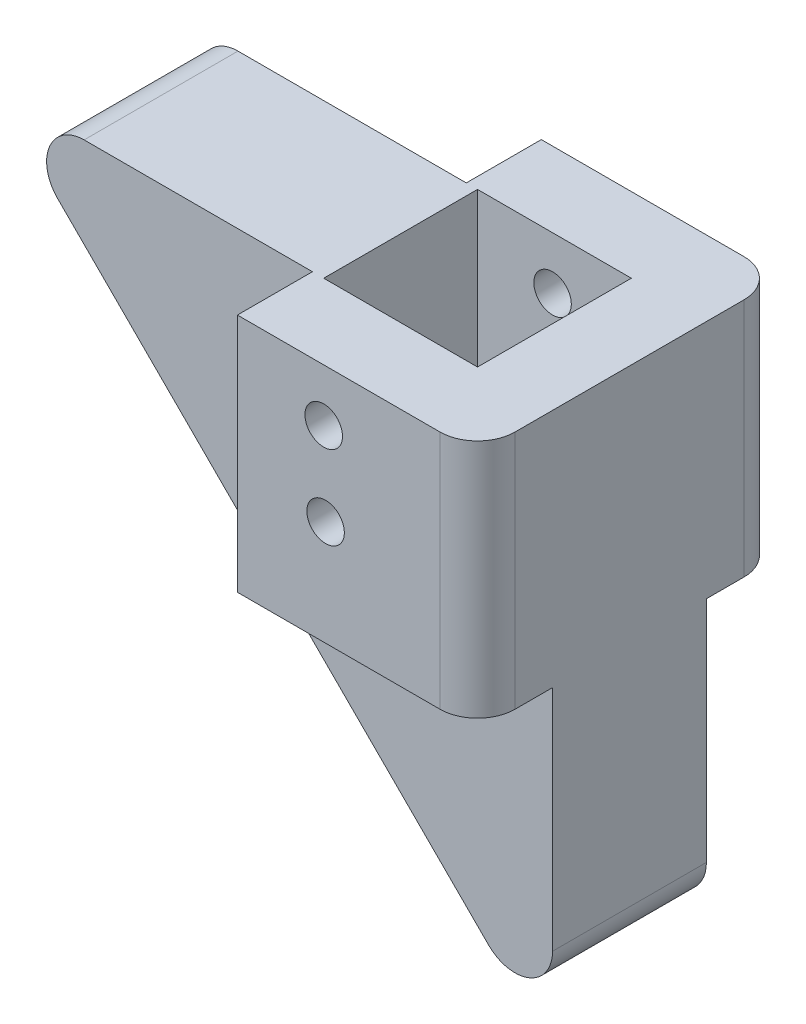
ISO-10303-21;
HEADER;
FILE_DESCRIPTION(('STEP AP214'),'2;1');
FILE_NAME('part.step','',(''),(''),'','','');
FILE_SCHEMA(('AUTOMOTIVE_DESIGN { 1 0 10303 214 1 1 1 1 }'));
ENDSEC;
DATA;
#1=APPLICATION_CONTEXT('core data for automotive mechanical design processes');
#2=APPLICATION_PROTOCOL_DEFINITION('international standard','automotive_design',2000,#1);
#3=PRODUCT_CONTEXT('',#1,'mechanical');
#4=PRODUCT('Part','Part','',(#3));
#5=PRODUCT_RELATED_PRODUCT_CATEGORY('part','',(#4));
#6=PRODUCT_DEFINITION_FORMATION('','',#4);
#7=PRODUCT_DEFINITION_CONTEXT('part definition',#1,'design');
#8=PRODUCT_DEFINITION('design','',#6,#7);
#9=PRODUCT_DEFINITION_SHAPE('','',#8);
#10=(LENGTH_UNIT() NAMED_UNIT(*) SI_UNIT(.MILLI.,.METRE.));
#11=(NAMED_UNIT(*) PLANE_ANGLE_UNIT() SI_UNIT($,.RADIAN.));
#12=(NAMED_UNIT(*) SI_UNIT($,.STERADIAN.) SOLID_ANGLE_UNIT());
#13=UNCERTAINTY_MEASURE_WITH_UNIT(LENGTH_MEASURE(1.E-05),#10,'distance_accuracy_value','');
#14=(GEOMETRIC_REPRESENTATION_CONTEXT(3) GLOBAL_UNCERTAINTY_ASSIGNED_CONTEXT((#13)) GLOBAL_UNIT_ASSIGNED_CONTEXT((#10,
#11,#12)) REPRESENTATION_CONTEXT('',''));
#15=CARTESIAN_POINT('',(0.,0.,0.));
#16=DIRECTION('',(0.,0.,1.));
#17=DIRECTION('',(1.,0.,0.));
#18=AXIS2_PLACEMENT_3D('',#15,#16,#17);
#19=CARTESIAN_POINT('',(0.,0.,0.));
#20=DIRECTION('',(0.,0.,1.));
#21=DIRECTION('',(1.,0.,0.));
#22=AXIS2_PLACEMENT_3D('',#19,#20,#21);
#23=PLANE('',#22);
#24=CARTESIAN_POINT('',(2.37412982933467,-20.8727925216274,0.));
#25=DIRECTION('',(0.,0.,1.));
#26=DIRECTION('',(1.,0.,0.));
#27=AXIS2_PLACEMENT_3D('',#24,#25,#26);
#28=CIRCLE('',#27,2.5);
#29=CARTESIAN_POINT('',(4.87412982933467,-20.8727925216274,0.));
#30=VERTEX_POINT('',#29);
#31=EDGE_CURVE('E208',#30,#30,#28,.T.);
#32=ORIENTED_EDGE('',*,*,#31,.T.);
#33=EDGE_LOOP('',(#32));
#34=FACE_BOUND('',#33,.T.);
#35=CARTESIAN_POINT('',(-12.298157313412,-6.20050537888066,0.));
#36=DIRECTION('',(0.,0.,1.));
#37=DIRECTION('',(1.,0.,0.));
#38=AXIS2_PLACEMENT_3D('',#35,#36,#37);
#39=CIRCLE('',#38,2.5);
#40=CARTESIAN_POINT('',(-9.79815731341203,-6.20050537888066,0.));
#41=VERTEX_POINT('',#40);
#42=EDGE_CURVE('E214',#41,#41,#39,.T.);
#43=ORIENTED_EDGE('',*,*,#42,.T.);
#44=EDGE_LOOP('',(#43));
#45=FACE_BOUND('',#44,.T.);
#46=DIRECTION('',(0.,-1.,0.));
#47=VECTOR('',#46,1.);
#48=CARTESIAN_POINT('',(26.701842686588,0.,0.));
#49=LINE('',#48,#47);
#50=CARTESIAN_POINT('',(26.701842686588,-13.8727925216274,0.));
#51=VERTEX_POINT('',#50);
#52=CARTESIAN_POINT('',(26.701842686588,-44.3017247097626,0.));
#53=VERTEX_POINT('',#52);
#54=EDGE_CURVE('E259',#51,#53,#49,.T.);
#55=ORIENTED_EDGE('',*,*,#54,.T.);
#56=CARTESIAN_POINT('',(21.701842686588,-44.3017247097626,0.));
#57=DIRECTION('',(0.,0.,1.));
#58=DIRECTION('',(1.,0.,0.));
#59=AXIS2_PLACEMENT_3D('',#56,#57,#58);
#60=CIRCLE('',#59,5.);
#61=CARTESIAN_POINT('',(18.1663087806552,-47.8372586156953,0.));
#62=VERTEX_POINT('',#61);
#63=EDGE_CURVE('E319',#53,#62,#60,.F.);
#64=ORIENTED_EDGE('',*,*,#63,.T.);
#65=DIRECTION('',(-0.707106781186544,0.707106781186551,0.));
#66=VECTOR('',#65,1.);
#67=CARTESIAN_POINT('',(-14.8354749175199,-14.8354749175198,0.));
#68=LINE('',#67,#66);
#69=CARTESIAN_POINT('',(-39.2626234074794,9.59167357243993,0.));
#70=VERTEX_POINT('',#69);
#71=EDGE_CURVE('E283',#62,#70,#68,.T.);
#72=ORIENTED_EDGE('',*,*,#71,.T.);
#73=CARTESIAN_POINT('',(-35.7270895015466,13.1272074783726,0.));
#74=DIRECTION('',(0.,0.,1.));
#75=DIRECTION('',(1.,0.,0.));
#76=AXIS2_PLACEMENT_3D('',#73,#74,#75);
#77=CIRCLE('',#76,5.);
#78=CARTESIAN_POINT('',(-35.7270895015466,18.1272074783727,0.));
#79=VERTEX_POINT('',#78);
#80=EDGE_CURVE('E317',#70,#79,#77,.F.);
#81=ORIENTED_EDGE('',*,*,#80,.T.);
#82=DIRECTION('',(1.,0.,0.));
#83=VECTOR('',#82,1.);
#84=CARTESIAN_POINT('',(0.,18.1272074783727,0.));
#85=LINE('',#84,#83);
#86=CARTESIAN_POINT('',(-5.29815731341203,18.1272074783727,0.));
#87=VERTEX_POINT('',#86);
#88=EDGE_CURVE('E281',#79,#87,#85,.T.);
#89=ORIENTED_EDGE('',*,*,#88,.T.);
#90=DIRECTION('',(0.,1.,0.));
#91=VECTOR('',#90,1.);
#92=CARTESIAN_POINT('',(-5.29815731341203,-13.8727925216274,0.));
#93=LINE('',#92,#91);
#94=CARTESIAN_POINT('',(-5.29815731341203,-13.8727925216274,0.));
#95=VERTEX_POINT('',#94);
#96=EDGE_CURVE('E247',#95,#87,#93,.T.);
#97=ORIENTED_EDGE('',*,*,#96,.F.);
#98=DIRECTION('',(-1.,0.,0.));
#99=VECTOR('',#98,1.);
#100=CARTESIAN_POINT('',(26.701842686588,-13.8727925216274,0.));
#101=LINE('',#100,#99);
#102=EDGE_CURVE('E178',#51,#95,#101,.T.);
#103=ORIENTED_EDGE('',*,*,#102,.F.);
#104=EDGE_LOOP('',(#55,#64,#72,#81,#89,#97,#103));
#105=FACE_BOUND('',#104,.T.);
#106=ADVANCED_FACE('F40',(#34,#45,#105),#23,.F.);
#107=CARTESIAN_POINT('',(16.701842686588,0.,20.5));
#108=DIRECTION('',(-1.,0.,0.));
#109=DIRECTION('',(0.,0.,1.));
#110=AXIS2_PLACEMENT_3D('',#107,#108,#109);
#111=PLANE('',#110);
#112=DIRECTION('',(0.,1.,0.));
#113=VECTOR('',#112,1.);
#114=CARTESIAN_POINT('',(16.701842686588,0.,0.));
#115=LINE('',#114,#113);
#116=CARTESIAN_POINT('',(16.701842686588,-6.87279252162735,0.));
#117=VERTEX_POINT('',#116);
#118=CARTESIAN_POINT('',(16.701842686588,18.1272074783727,0.));
#119=VERTEX_POINT('',#118);
#120=EDGE_CURVE('E254',#117,#119,#115,.T.);
#121=ORIENTED_EDGE('',*,*,#120,.F.);
#122=DIRECTION('',(0.,0.,-1.));
#123=VECTOR('',#122,1.);
#124=CARTESIAN_POINT('',(16.701842686588,-6.87279252162735,20.5));
#125=LINE('',#124,#123);
#126=CARTESIAN_POINT('',(16.701842686588,-6.87279252162735,20.5));
#127=VERTEX_POINT('',#126);
#128=EDGE_CURVE('E296',#127,#117,#125,.T.);
#129=ORIENTED_EDGE('',*,*,#128,.F.);
#130=DIRECTION('',(0.,1.,0.));
#131=VECTOR('',#130,1.);
#132=CARTESIAN_POINT('',(16.701842686588,0.,20.5));
#133=LINE('',#132,#131);
#134=CARTESIAN_POINT('',(16.701842686588,18.1272074783727,20.5));
#135=VERTEX_POINT('',#134);
#136=EDGE_CURVE('E255',#127,#135,#133,.T.);
#137=ORIENTED_EDGE('',*,*,#136,.T.);
#138=DIRECTION('',(0.,0.,-1.));
#139=VECTOR('',#138,1.);
#140=CARTESIAN_POINT('',(16.701842686588,18.1272074783727,20.5));
#141=LINE('',#140,#139);
#142=EDGE_CURVE('E272',#135,#119,#141,.T.);
#143=ORIENTED_EDGE('',*,*,#142,.T.);
#144=EDGE_LOOP('',(#121,#129,#137,#143));
#145=FACE_BOUND('',#144,.T.);
#146=ADVANCED_FACE('F381',(#145),#111,.T.);
#147=CARTESIAN_POINT('',(0.,-6.87279252162735,20.5));
#148=DIRECTION('',(0.,1.,0.));
#149=DIRECTION('',(0.,0.,1.));
#150=AXIS2_PLACEMENT_3D('',#147,#148,#149);
#151=PLANE('',#150);
#152=DIRECTION('',(1.,0.,0.));
#153=VECTOR('',#152,1.);
#154=CARTESIAN_POINT('',(0.,-6.87279252162735,0.));
#155=LINE('',#154,#153);
#156=CARTESIAN_POINT('',(-3.79815731341203,-6.87279252162735,0.));
#157=VERTEX_POINT('',#156);
#158=EDGE_CURVE('E275',#157,#117,#155,.T.);
#159=ORIENTED_EDGE('',*,*,#158,.F.);
#160=DIRECTION('',(0.,0.,-1.));
#161=VECTOR('',#160,1.);
#162=CARTESIAN_POINT('',(-3.79815731341203,-6.87279252162735,20.5));
#163=LINE('',#162,#161);
#164=CARTESIAN_POINT('',(-3.79815731341203,-6.87279252162735,20.5));
#165=VERTEX_POINT('',#164);
#166=EDGE_CURVE('E294',#165,#157,#163,.T.);
#167=ORIENTED_EDGE('',*,*,#166,.F.);
#168=DIRECTION('',(1.,0.,0.));
#169=VECTOR('',#168,1.);
#170=CARTESIAN_POINT('',(0.,-6.87279252162735,20.5));
#171=LINE('',#170,#169);
#172=EDGE_CURVE('E258',#165,#127,#171,.T.);
#173=ORIENTED_EDGE('',*,*,#172,.T.);
#174=ORIENTED_EDGE('',*,*,#128,.T.);
#175=EDGE_LOOP('',(#159,#167,#173,#174));
#176=FACE_BOUND('',#175,.T.);
#177=ADVANCED_FACE('F387',(#176),#151,.T.);
#178=CARTESIAN_POINT('',(-3.79815731341203,0.,20.5));
#179=DIRECTION('',(1.,0.,0.));
#180=DIRECTION('',(0.,0.,-1.));
#181=AXIS2_PLACEMENT_3D('',#178,#179,#180);
#182=PLANE('',#181);
#183=DIRECTION('',(0.,-1.,0.));
#184=VECTOR('',#183,1.);
#185=CARTESIAN_POINT('',(-3.79815731341203,0.,0.));
#186=LINE('',#185,#184);
#187=CARTESIAN_POINT('',(-3.79815731341203,18.1272074783727,0.));
#188=VERTEX_POINT('',#187);
#189=EDGE_CURVE('E278',#188,#157,#186,.T.);
#190=ORIENTED_EDGE('',*,*,#189,.F.);
#191=DIRECTION('',(0.,0.,-1.));
#192=VECTOR('',#191,1.);
#193=CARTESIAN_POINT('',(-3.79815731341203,18.1272074783727,20.5));
#194=LINE('',#193,#192);
#195=CARTESIAN_POINT('',(-3.79815731341203,18.1272074783727,20.5));
#196=VERTEX_POINT('',#195);
#197=EDGE_CURVE('E292',#196,#188,#194,.T.);
#198=ORIENTED_EDGE('',*,*,#197,.F.);
#199=DIRECTION('',(0.,-1.,0.));
#200=VECTOR('',#199,1.);
#201=CARTESIAN_POINT('',(-3.79815731341203,0.,20.5));
#202=LINE('',#201,#200);
#203=EDGE_CURVE('E262',#196,#165,#202,.T.);
#204=ORIENTED_EDGE('',*,*,#203,.T.);
#205=ORIENTED_EDGE('',*,*,#166,.T.);
#206=EDGE_LOOP('',(#190,#198,#204,#205));
#207=FACE_BOUND('',#206,.T.);
#208=ADVANCED_FACE('F401',(#207),#182,.T.);
#209=CARTESIAN_POINT('',(-14.8354749175199,-14.8354749175198,20.5));
#210=DIRECTION('',(-0.707106781186551,-0.707106781186544,0.));
#211=DIRECTION('',(0.707106781186544,-0.707106781186551,0.));
#212=AXIS2_PLACEMENT_3D('',#209,#210,#211);
#213=PLANE('',#212);
#214=ORIENTED_EDGE('',*,*,#71,.F.);
#215=DIRECTION('',(0.,0.,-1.));
#216=VECTOR('',#215,1.);
#217=CARTESIAN_POINT('',(18.1663087806552,-47.8372586156953,20.5));
#218=LINE('',#217,#216);
#219=CARTESIAN_POINT('',(18.1663087806552,-47.8372586156953,20.5));
#220=VERTEX_POINT('',#219);
#221=EDGE_CURVE('E324',#62,#220,#218,.F.);
#222=ORIENTED_EDGE('',*,*,#221,.T.);
#223=DIRECTION('',(-0.707106781186544,0.707106781186551,0.));
#224=VECTOR('',#223,1.);
#225=CARTESIAN_POINT('',(-14.8354749175199,-14.8354749175198,20.5));
#226=LINE('',#225,#224);
#227=CARTESIAN_POINT('',(-39.2626234074794,9.59167357243993,20.5));
#228=VERTEX_POINT('',#227);
#229=EDGE_CURVE('E267',#220,#228,#226,.T.);
#230=ORIENTED_EDGE('',*,*,#229,.T.);
#231=DIRECTION('',(0.,0.,-1.));
#232=VECTOR('',#231,1.);
#233=CARTESIAN_POINT('',(-39.2626234074794,9.59167357243993,20.5));
#234=LINE('',#233,#232);
#235=EDGE_CURVE('E321',#228,#70,#234,.T.);
#236=ORIENTED_EDGE('',*,*,#235,.T.);
#237=EDGE_LOOP('',(#214,#222,#230,#236));
#238=FACE_BOUND('',#237,.T.);
#239=ADVANCED_FACE('F340',(#238),#213,.T.);
#240=CARTESIAN_POINT('',(26.701842686588,0.,20.5));
#241=DIRECTION('',(1.,0.,0.));
#242=DIRECTION('',(0.,1.,0.));
#243=AXIS2_PLACEMENT_3D('',#240,#241,#242);
#244=PLANE('',#243);
#245=DIRECTION('',(0.,-1.,0.));
#246=VECTOR('',#245,1.);
#247=CARTESIAN_POINT('',(26.701842686588,0.,20.5));
#248=LINE('',#247,#246);
#249=CARTESIAN_POINT('',(26.701842686588,-13.8727925216274,20.5));
#250=VERTEX_POINT('',#249);
#251=CARTESIAN_POINT('',(26.701842686588,-44.3017247097626,20.5));
#252=VERTEX_POINT('',#251);
#253=EDGE_CURVE('E269',#250,#252,#248,.T.);
#254=ORIENTED_EDGE('',*,*,#253,.T.);
#255=DIRECTION('',(0.,0.,-1.));
#256=VECTOR('',#255,1.);
#257=CARTESIAN_POINT('',(26.701842686588,-44.3017247097626,20.5));
#258=LINE('',#257,#256);
#259=EDGE_CURVE('E314',#252,#53,#258,.T.);
#260=ORIENTED_EDGE('',*,*,#259,.T.);
#261=ORIENTED_EDGE('',*,*,#54,.F.);
#262=DIRECTION('',(0.,0.,1.));
#263=VECTOR('',#262,1.);
#264=CARTESIAN_POINT('',(26.701842686588,-13.8727925216274,-8.));
#265=LINE('',#264,#263);
#266=CARTESIAN_POINT('',(26.701842686588,-13.8727925216274,-5.));
#267=VERTEX_POINT('',#266);
#268=EDGE_CURVE('E181',#267,#51,#265,.T.);
#269=ORIENTED_EDGE('',*,*,#268,.F.);
#270=DIRECTION('',(0.,-1.,0.));
#271=VECTOR('',#270,1.);
#272=CARTESIAN_POINT('',(26.701842686588,18.1272074783727,-5.));
#273=LINE('',#272,#271);
#274=CARTESIAN_POINT('',(26.701842686588,18.1272074783727,-5.));
#275=VERTEX_POINT('',#274);
#276=EDGE_CURVE('E303',#267,#275,#273,.F.);
#277=ORIENTED_EDGE('',*,*,#276,.T.);
#278=DIRECTION('',(0.,0.,-1.));
#279=VECTOR('',#278,1.);
#280=CARTESIAN_POINT('',(26.701842686588,18.1272074783727,20.5));
#281=LINE('',#280,#279);
#282=CARTESIAN_POINT('',(26.701842686588,18.1272074783727,25.5));
#283=VERTEX_POINT('',#282);
#284=EDGE_CURVE('E289',#283,#275,#281,.T.);
#285=ORIENTED_EDGE('',*,*,#284,.F.);
#286=DIRECTION('',(0.,1.,0.));
#287=VECTOR('',#286,1.);
#288=CARTESIAN_POINT('',(26.701842686588,-13.8727925216274,25.5));
#289=LINE('',#288,#287);
#290=CARTESIAN_POINT('',(26.701842686588,-13.8727925216274,25.5));
#291=VERTEX_POINT('',#290);
#292=EDGE_CURVE('E301',#283,#291,#289,.F.);
#293=ORIENTED_EDGE('',*,*,#292,.T.);
#294=DIRECTION('',(0.,0.,-1.));
#295=VECTOR('',#294,1.);
#296=CARTESIAN_POINT('',(26.701842686588,-13.8727925216274,27.5));
#297=LINE('',#296,#295);
#298=EDGE_CURVE('E238',#291,#250,#297,.T.);
#299=ORIENTED_EDGE('',*,*,#298,.T.);
#300=EDGE_LOOP('',(#254,#260,#261,#269,#277,#285,#293,#299));
#301=FACE_BOUND('',#300,.T.);
#302=ADVANCED_FACE('F333',(#301),#244,.T.);
#303=CARTESIAN_POINT('',(0.,18.1272074783727,20.5));
#304=DIRECTION('',(0.,1.,0.));
#305=DIRECTION('',(0.,0.,1.));
#306=AXIS2_PLACEMENT_3D('',#303,#304,#305);
#307=PLANE('',#306);
#308=DIRECTION('',(-1.,0.,0.));
#309=VECTOR('',#308,1.);
#310=CARTESIAN_POINT('',(26.701842686588,18.1272074783727,20.5));
#311=LINE('',#310,#309);
#312=EDGE_CURVE('E229',#135,#196,#311,.T.);
#313=ORIENTED_EDGE('',*,*,#312,.T.);
#314=ORIENTED_EDGE('',*,*,#197,.T.);
#315=DIRECTION('',(1.,0.,0.));
#316=VECTOR('',#315,1.);
#317=CARTESIAN_POINT('',(26.701842686588,18.1272074783726,0.));
#318=LINE('',#317,#316);
#319=EDGE_CURVE('E249',#188,#119,#318,.T.);
#320=ORIENTED_EDGE('',*,*,#319,.T.);
#321=ORIENTED_EDGE('',*,*,#142,.F.);
#322=EDGE_LOOP('',(#313,#314,#320,#321));
#323=FACE_BOUND('',#322,.T.);
#324=ORIENTED_EDGE('',*,*,#88,.F.);
#325=DIRECTION('',(0.,0.,-1.));
#326=VECTOR('',#325,1.);
#327=CARTESIAN_POINT('',(-35.7270895015466,18.1272074783727,20.5));
#328=LINE('',#327,#326);
#329=CARTESIAN_POINT('',(-35.7270895015466,18.1272074783727,20.5));
#330=VERTEX_POINT('',#329);
#331=EDGE_CURVE('E11',#79,#330,#328,.F.);
#332=ORIENTED_EDGE('',*,*,#331,.T.);
#333=DIRECTION('',(1.,0.,0.));
#334=VECTOR('',#333,1.);
#335=CARTESIAN_POINT('',(0.,18.1272074783727,20.5));
#336=LINE('',#335,#334);
#337=CARTESIAN_POINT('',(-5.29815731341203,18.1272074783727,20.5));
#338=VERTEX_POINT('',#337);
#339=EDGE_CURVE('E265',#330,#338,#336,.T.);
#340=ORIENTED_EDGE('',*,*,#339,.T.);
#341=DIRECTION('',(0.,0.,-1.));
#342=VECTOR('',#341,1.);
#343=CARTESIAN_POINT('',(-5.29815731341203,18.1272074783726,27.5));
#344=LINE('',#343,#342);
#345=CARTESIAN_POINT('',(-5.29815731341202,18.1272074783727,30.5));
#346=VERTEX_POINT('',#345);
#347=EDGE_CURVE('E243',#346,#338,#344,.T.);
#348=ORIENTED_EDGE('',*,*,#347,.F.);
#349=DIRECTION('',(-1.,0.,0.));
#350=VECTOR('',#349,1.);
#351=CARTESIAN_POINT('',(-5.29815731341202,18.1272074783727,30.5));
#352=LINE('',#351,#350);
#353=CARTESIAN_POINT('',(21.701842686588,18.1272074783727,30.5));
#354=VERTEX_POINT('',#353);
#355=EDGE_CURVE('E203',#354,#346,#352,.T.);
#356=ORIENTED_EDGE('',*,*,#355,.F.);
#357=CARTESIAN_POINT('',(21.701842686588,18.1272074783727,25.5));
#358=DIRECTION('',(0.,1.,0.));
#359=DIRECTION('',(0.,0.,1.));
#360=AXIS2_PLACEMENT_3D('',#357,#358,#359);
#361=CIRCLE('',#360,5.);
#362=EDGE_CURVE('E305',#354,#283,#361,.T.);
#363=ORIENTED_EDGE('',*,*,#362,.T.);
#364=ORIENTED_EDGE('',*,*,#284,.T.);
#365=CARTESIAN_POINT('',(21.701842686588,18.1272074783727,-5.));
#366=DIRECTION('',(0.,1.,0.));
#367=DIRECTION('',(0.,0.,1.));
#368=AXIS2_PLACEMENT_3D('',#365,#366,#367);
#369=CIRCLE('',#368,5.);
#370=CARTESIAN_POINT('',(21.701842686588,18.1272074783727,-10.));
#371=VERTEX_POINT('',#370);
#372=EDGE_CURVE('E307',#275,#371,#369,.T.);
#373=ORIENTED_EDGE('',*,*,#372,.T.);
#374=DIRECTION('',(1.,0.,0.));
#375=VECTOR('',#374,1.);
#376=CARTESIAN_POINT('',(26.701842686588,18.1272074783727,-10.));
#377=LINE('',#376,#375);
#378=CARTESIAN_POINT('',(-5.29815731341203,18.1272074783727,-10.));
#379=VERTEX_POINT('',#378);
#380=EDGE_CURVE('E186',#379,#371,#377,.T.);
#381=ORIENTED_EDGE('',*,*,#380,.F.);
#382=DIRECTION('',(0.,0.,1.));
#383=VECTOR('',#382,1.);
#384=CARTESIAN_POINT('',(-5.29815731341203,18.1272074783726,-8.));
#385=LINE('',#384,#383);
#386=EDGE_CURVE('E182',#379,#87,#385,.T.);
#387=ORIENTED_EDGE('',*,*,#386,.T.);
#388=EDGE_LOOP('',(#324,#332,#340,#348,#356,#363,#364,#373,#381,#387));
#389=FACE_BOUND('',#388,.T.);
#390=ADVANCED_FACE('F343',(#323,#389),#307,.T.);
#391=CARTESIAN_POINT('',(0.,0.,20.5));
#392=DIRECTION('',(0.,0.,1.));
#393=DIRECTION('',(1.,0.,0.));
#394=AXIS2_PLACEMENT_3D('',#391,#392,#393);
#395=PLANE('',#394);
#396=CARTESIAN_POINT('',(2.37412982933467,-20.8727925216274,20.5));
#397=DIRECTION('',(0.,0.,1.));
#398=DIRECTION('',(1.,0.,0.));
#399=AXIS2_PLACEMENT_3D('',#396,#397,#398);
#400=CIRCLE('',#399,2.5);
#401=CARTESIAN_POINT('',(4.87412982933467,-20.8727925216274,20.5));
#402=VERTEX_POINT('',#401);
#403=EDGE_CURVE('E205',#402,#402,#400,.T.);
#404=ORIENTED_EDGE('',*,*,#403,.F.);
#405=EDGE_LOOP('',(#404));
#406=FACE_BOUND('',#405,.T.);
#407=CARTESIAN_POINT('',(-12.298157313412,-6.20050537888066,20.5));
#408=DIRECTION('',(0.,0.,1.));
#409=DIRECTION('',(1.,0.,0.));
#410=AXIS2_PLACEMENT_3D('',#407,#408,#409);
#411=CIRCLE('',#410,2.5);
#412=CARTESIAN_POINT('',(-9.79815731341203,-6.20050537888066,20.5));
#413=VERTEX_POINT('',#412);
#414=EDGE_CURVE('E211',#413,#413,#411,.T.);
#415=ORIENTED_EDGE('',*,*,#414,.F.);
#416=EDGE_LOOP('',(#415));
#417=FACE_BOUND('',#416,.T.);
#418=ORIENTED_EDGE('',*,*,#229,.F.);
#419=CARTESIAN_POINT('',(21.701842686588,-44.3017247097626,20.5));
#420=DIRECTION('',(0.,0.,1.));
#421=DIRECTION('',(1.,0.,0.));
#422=AXIS2_PLACEMENT_3D('',#419,#420,#421);
#423=CIRCLE('',#422,5.);
#424=EDGE_CURVE('E48',#220,#252,#423,.T.);
#425=ORIENTED_EDGE('',*,*,#424,.T.);
#426=ORIENTED_EDGE('',*,*,#253,.F.);
#427=DIRECTION('',(1.,0.,0.));
#428=VECTOR('',#427,1.);
#429=CARTESIAN_POINT('',(26.701842686588,-13.8727925216274,20.5));
#430=LINE('',#429,#428);
#431=CARTESIAN_POINT('',(-5.29815731341202,-13.8727925216274,20.5));
#432=VERTEX_POINT('',#431);
#433=EDGE_CURVE('E235',#432,#250,#430,.T.);
#434=ORIENTED_EDGE('',*,*,#433,.F.);
#435=DIRECTION('',(0.,-1.,0.));
#436=VECTOR('',#435,1.);
#437=CARTESIAN_POINT('',(-5.29815731341203,18.1272074783726,20.5));
#438=LINE('',#437,#436);
#439=EDGE_CURVE('E232',#338,#432,#438,.T.);
#440=ORIENTED_EDGE('',*,*,#439,.F.);
#441=ORIENTED_EDGE('',*,*,#339,.F.);
#442=CARTESIAN_POINT('',(-35.7270895015466,13.1272074783726,20.5));
#443=DIRECTION('',(0.,0.,1.));
#444=DIRECTION('',(1.,0.,0.));
#445=AXIS2_PLACEMENT_3D('',#442,#443,#444);
#446=CIRCLE('',#445,5.);
#447=EDGE_CURVE('E60',#330,#228,#446,.T.);
#448=ORIENTED_EDGE('',*,*,#447,.T.);
#449=EDGE_LOOP('',(#418,#425,#426,#434,#440,#441,#448));
#450=FACE_BOUND('',#449,.T.);
#451=ADVANCED_FACE('F328',(#406,#417,#450),#395,.T.);
#452=CARTESIAN_POINT('',(26.701842686588,-13.8727925216274,-8.));
#453=DIRECTION('',(0.,1.,0.));
#454=DIRECTION('',(0.,0.,1.));
#455=AXIS2_PLACEMENT_3D('',#452,#453,#454);
#456=PLANE('',#455);
#457=DIRECTION('',(-1.,0.,0.));
#458=VECTOR('',#457,1.);
#459=CARTESIAN_POINT('',(26.701842686588,-13.8727925216274,-10.));
#460=LINE('',#459,#458);
#461=CARTESIAN_POINT('',(21.701842686588,-13.8727925216274,-10.));
#462=VERTEX_POINT('',#461);
#463=CARTESIAN_POINT('',(-5.29815731341202,-13.8727925216274,-10.));
#464=VERTEX_POINT('',#463);
#465=EDGE_CURVE('E160',#462,#464,#460,.T.);
#466=ORIENTED_EDGE('',*,*,#465,.F.);
#467=CARTESIAN_POINT('',(21.701842686588,-13.8727925216274,-5.));
#468=DIRECTION('',(0.,1.,0.));
#469=DIRECTION('',(0.,0.,1.));
#470=AXIS2_PLACEMENT_3D('',#467,#468,#469);
#471=CIRCLE('',#470,5.);
#472=EDGE_CURVE('E299',#462,#267,#471,.F.);
#473=ORIENTED_EDGE('',*,*,#472,.T.);
#474=ORIENTED_EDGE('',*,*,#268,.T.);
#475=ORIENTED_EDGE('',*,*,#102,.T.);
#476=DIRECTION('',(0.,0.,1.));
#477=VECTOR('',#476,1.);
#478=CARTESIAN_POINT('',(-5.29815731341203,-13.8727925216274,-8.));
#479=LINE('',#478,#477);
#480=EDGE_CURVE('E175',#464,#95,#479,.T.);
#481=ORIENTED_EDGE('',*,*,#480,.F.);
#482=EDGE_LOOP('',(#466,#473,#474,#475,#481));
#483=FACE_BOUND('',#482,.T.);
#484=ADVANCED_FACE('F176',(#483),#456,.F.);
#485=CARTESIAN_POINT('',(-5.29815731341203,-13.8727925216274,-8.));
#486=DIRECTION('',(1.,0.,0.));
#487=DIRECTION('',(0.,0.,-1.));
#488=AXIS2_PLACEMENT_3D('',#485,#486,#487);
#489=PLANE('',#488);
#490=ORIENTED_EDGE('',*,*,#96,.T.);
#491=ORIENTED_EDGE('',*,*,#386,.F.);
#492=DIRECTION('',(0.,1.,0.));
#493=VECTOR('',#492,1.);
#494=CARTESIAN_POINT('',(-5.29815731341202,-13.8727925216274,-10.));
#495=LINE('',#494,#493);
#496=EDGE_CURVE('E166',#464,#379,#495,.T.);
#497=ORIENTED_EDGE('',*,*,#496,.F.);
#498=ORIENTED_EDGE('',*,*,#480,.T.);
#499=EDGE_LOOP('',(#490,#491,#497,#498));
#500=FACE_BOUND('',#499,.T.);
#501=ADVANCED_FACE('F184',(#500),#489,.F.);
#502=CARTESIAN_POINT('',(0.,0.,0.));
#503=DIRECTION('',(0.,0.,1.));
#504=DIRECTION('',(1.,0.,0.));
#505=AXIS2_PLACEMENT_3D('',#502,#503,#504);
#506=PLANE('',#505);
#507=CARTESIAN_POINT('',(6.20184268658797,11.1272074783727,0.));
#508=DIRECTION('',(0.,0.,1.));
#509=DIRECTION('',(1.,0.,0.));
#510=AXIS2_PLACEMENT_3D('',#507,#508,#509);
#511=CIRCLE('',#510,2.5);
#512=CARTESIAN_POINT('',(8.70184268658797,11.1272074783727,0.));
#513=VERTEX_POINT('',#512);
#514=EDGE_CURVE('E220',#513,#513,#511,.T.);
#515=ORIENTED_EDGE('',*,*,#514,.F.);
#516=EDGE_LOOP('',(#515));
#517=FACE_BOUND('',#516,.T.);
#518=CARTESIAN_POINT('',(6.45184268658797,0.127207478372648,0.));
#519=DIRECTION('',(0.,0.,1.));
#520=DIRECTION('',(1.,0.,0.));
#521=AXIS2_PLACEMENT_3D('',#518,#519,#520);
#522=CIRCLE('',#521,2.5);
#523=CARTESIAN_POINT('',(8.95184268658797,0.127207478372648,0.));
#524=VERTEX_POINT('',#523);
#525=EDGE_CURVE('E226',#524,#524,#522,.T.);
#526=ORIENTED_EDGE('',*,*,#525,.F.);
#527=EDGE_LOOP('',(#526));
#528=FACE_BOUND('',#527,.T.);
#529=ORIENTED_EDGE('',*,*,#158,.T.);
#530=ORIENTED_EDGE('',*,*,#120,.T.);
#531=ORIENTED_EDGE('',*,*,#319,.F.);
#532=ORIENTED_EDGE('',*,*,#189,.T.);
#533=EDGE_LOOP('',(#529,#530,#531,#532));
#534=FACE_BOUND('',#533,.T.);
#535=ADVANCED_FACE('F376',(#517,#528,#534),#506,.T.);
#536=CARTESIAN_POINT('',(0.,0.,20.5));
#537=DIRECTION('',(0.,0.,-1.));
#538=DIRECTION('',(-1.,0.,0.));
#539=AXIS2_PLACEMENT_3D('',#536,#537,#538);
#540=PLANE('',#539);
#541=CARTESIAN_POINT('',(6.20184268658797,11.1272074783727,20.5));
#542=DIRECTION('',(0.,0.,-1.));
#543=DIRECTION('',(-1.,0.,0.));
#544=AXIS2_PLACEMENT_3D('',#541,#542,#543);
#545=CIRCLE('',#544,2.5);
#546=CARTESIAN_POINT('',(3.70184268658797,11.1272074783727,20.5));
#547=VERTEX_POINT('',#546);
#548=EDGE_CURVE('E217',#547,#547,#545,.T.);
#549=ORIENTED_EDGE('',*,*,#548,.F.);
#550=EDGE_LOOP('',(#549));
#551=FACE_BOUND('',#550,.T.);
#552=CARTESIAN_POINT('',(6.45184268658797,0.127207478372648,20.5));
#553=DIRECTION('',(0.,0.,-1.));
#554=DIRECTION('',(-1.,0.,0.));
#555=AXIS2_PLACEMENT_3D('',#552,#553,#554);
#556=CIRCLE('',#555,2.5);
#557=CARTESIAN_POINT('',(3.95184268658797,0.127207478372648,20.5));
#558=VERTEX_POINT('',#557);
#559=EDGE_CURVE('E223',#558,#558,#556,.T.);
#560=ORIENTED_EDGE('',*,*,#559,.F.);
#561=EDGE_LOOP('',(#560));
#562=FACE_BOUND('',#561,.T.);
#563=ORIENTED_EDGE('',*,*,#136,.F.);
#564=ORIENTED_EDGE('',*,*,#172,.F.);
#565=ORIENTED_EDGE('',*,*,#203,.F.);
#566=ORIENTED_EDGE('',*,*,#312,.F.);
#567=EDGE_LOOP('',(#563,#564,#565,#566));
#568=FACE_BOUND('',#567,.T.);
#569=ADVANCED_FACE('F368',(#551,#562,#568),#540,.T.);
#570=CARTESIAN_POINT('',(-5.29815731341203,18.1272074783726,27.5));
#571=DIRECTION('',(1.,0.,0.));
#572=DIRECTION('',(0.,1.,0.));
#573=AXIS2_PLACEMENT_3D('',#570,#571,#572);
#574=PLANE('',#573);
#575=ORIENTED_EDGE('',*,*,#439,.T.);
#576=DIRECTION('',(0.,0.,-1.));
#577=VECTOR('',#576,1.);
#578=CARTESIAN_POINT('',(-5.29815731341202,-13.8727925216274,27.5));
#579=LINE('',#578,#577);
#580=CARTESIAN_POINT('',(-5.29815731341202,-13.8727925216274,30.5));
#581=VERTEX_POINT('',#580);
#582=EDGE_CURVE('E240',#581,#432,#579,.T.);
#583=ORIENTED_EDGE('',*,*,#582,.F.);
#584=DIRECTION('',(0.,-1.,0.));
#585=VECTOR('',#584,1.);
#586=CARTESIAN_POINT('',(-5.29815731341202,-13.8727925216274,30.5));
#587=LINE('',#586,#585);
#588=EDGE_CURVE('E197',#346,#581,#587,.T.);
#589=ORIENTED_EDGE('',*,*,#588,.F.);
#590=ORIENTED_EDGE('',*,*,#347,.T.);
#591=EDGE_LOOP('',(#575,#583,#589,#590));
#592=FACE_BOUND('',#591,.T.);
#593=ADVANCED_FACE('F366',(#592),#574,.F.);
#594=CARTESIAN_POINT('',(26.701842686588,-13.8727925216274,27.5));
#595=DIRECTION('',(0.,1.,0.));
#596=DIRECTION('',(-1.,0.,0.));
#597=AXIS2_PLACEMENT_3D('',#594,#595,#596);
#598=PLANE('',#597);
#599=ORIENTED_EDGE('',*,*,#298,.F.);
#600=CARTESIAN_POINT('',(21.701842686588,-13.8727925216274,25.5));
#601=DIRECTION('',(0.,1.,0.));
#602=DIRECTION('',(-1.,0.,0.));
#603=AXIS2_PLACEMENT_3D('',#600,#601,#602);
#604=CIRCLE('',#603,5.);
#605=CARTESIAN_POINT('',(21.701842686588,-13.8727925216274,30.5));
#606=VERTEX_POINT('',#605);
#607=EDGE_CURVE('E312',#291,#606,#604,.F.);
#608=ORIENTED_EDGE('',*,*,#607,.T.);
#609=DIRECTION('',(1.,0.,0.));
#610=VECTOR('',#609,1.);
#611=CARTESIAN_POINT('',(-5.29815731341202,-13.8727925216274,30.5));
#612=LINE('',#611,#610);
#613=EDGE_CURVE('E200',#581,#606,#612,.T.);
#614=ORIENTED_EDGE('',*,*,#613,.F.);
#615=ORIENTED_EDGE('',*,*,#582,.T.);
#616=ORIENTED_EDGE('',*,*,#433,.T.);
#617=EDGE_LOOP('',(#599,#608,#614,#615,#616));
#618=FACE_BOUND('',#617,.T.);
#619=ADVANCED_FACE('F363',(#618),#598,.F.);
#620=CARTESIAN_POINT('',(6.45184268658797,0.127207478372648,32.));
#621=DIRECTION('',(0.,0.,-1.));
#622=DIRECTION('',(-1.,0.,0.));
#623=AXIS2_PLACEMENT_3D('',#620,#621,#622);
#624=CYLINDRICAL_SURFACE('',#623,2.5);
#625=ORIENTED_EDGE('',*,*,#559,.T.);
#626=EDGE_LOOP('',(#625));
#627=FACE_BOUND('',#626,.T.);
#628=CARTESIAN_POINT('',(6.45184268658797,0.127207478372648,30.5));
#629=DIRECTION('',(0.,0.,1.));
#630=DIRECTION('',(1.,0.,0.));
#631=AXIS2_PLACEMENT_3D('',#628,#629,#630);
#632=CIRCLE('',#631,2.5);
#633=CARTESIAN_POINT('',(8.95184268658797,0.127207478372648,30.5));
#634=VERTEX_POINT('',#633);
#635=EDGE_CURVE('E188',#634,#634,#632,.T.);
#636=ORIENTED_EDGE('',*,*,#635,.T.);
#637=EDGE_LOOP('',(#636));
#638=FACE_BOUND('',#637,.T.);
#639=ADVANCED_FACE('F374',(#627,#638),#624,.F.);
#640=ORIENTED_EDGE('',*,*,#525,.T.);
#641=EDGE_LOOP('',(#640));
#642=FACE_BOUND('',#641,.T.);
#643=CARTESIAN_POINT('',(6.45184268658797,0.127207478372648,-10.));
#644=DIRECTION('',(0.,0.,-1.));
#645=DIRECTION('',(-1.,0.,0.));
#646=AXIS2_PLACEMENT_3D('',#643,#644,#645);
#647=CIRCLE('',#646,2.5);
#648=CARTESIAN_POINT('',(3.95184268658797,0.127207478372648,-10.));
#649=VERTEX_POINT('',#648);
#650=EDGE_CURVE('E652',#649,#649,#647,.T.);
#651=ORIENTED_EDGE('',*,*,#650,.T.);
#652=EDGE_LOOP('',(#651));
#653=FACE_BOUND('',#652,.T.);
#654=ADVANCED_FACE('F529',(#642,#653),#624,.F.);
#655=CARTESIAN_POINT('',(6.20184268658797,11.1272074783727,32.));
#656=DIRECTION('',(0.,0.,-1.));
#657=DIRECTION('',(-1.,0.,0.));
#658=AXIS2_PLACEMENT_3D('',#655,#656,#657);
#659=CYLINDRICAL_SURFACE('',#658,2.5);
#660=ORIENTED_EDGE('',*,*,#548,.T.);
#661=EDGE_LOOP('',(#660));
#662=FACE_BOUND('',#661,.T.);
#663=CARTESIAN_POINT('',(6.20184268658797,11.1272074783727,30.5));
#664=DIRECTION('',(0.,0.,1.));
#665=DIRECTION('',(1.,0.,0.));
#666=AXIS2_PLACEMENT_3D('',#663,#664,#665);
#667=CIRCLE('',#666,2.5);
#668=CARTESIAN_POINT('',(8.70184268658797,11.1272074783727,30.5));
#669=VERTEX_POINT('',#668);
#670=EDGE_CURVE('E194',#669,#669,#667,.T.);
#671=ORIENTED_EDGE('',*,*,#670,.T.);
#672=EDGE_LOOP('',(#671));
#673=FACE_BOUND('',#672,.T.);
#674=ADVANCED_FACE('F519',(#662,#673),#659,.F.);
#675=ORIENTED_EDGE('',*,*,#514,.T.);
#676=EDGE_LOOP('',(#675));
#677=FACE_BOUND('',#676,.T.);
#678=CARTESIAN_POINT('',(6.20184268658797,11.1272074783727,-10.));
#679=DIRECTION('',(0.,0.,-1.));
#680=DIRECTION('',(-1.,0.,0.));
#681=AXIS2_PLACEMENT_3D('',#678,#679,#680);
#682=CIRCLE('',#681,2.5);
#683=CARTESIAN_POINT('',(3.70184268658797,11.1272074783727,-10.));
#684=VERTEX_POINT('',#683);
#685=EDGE_CURVE('E171',#684,#684,#682,.T.);
#686=ORIENTED_EDGE('',*,*,#685,.T.);
#687=EDGE_LOOP('',(#686));
#688=FACE_BOUND('',#687,.T.);
#689=ADVANCED_FACE('F514',(#677,#688),#659,.F.);
#690=CARTESIAN_POINT('',(-12.298157313412,-6.20050537888066,-19.5));
#691=DIRECTION('',(0.,0.,1.));
#692=DIRECTION('',(1.,0.,0.));
#693=AXIS2_PLACEMENT_3D('',#690,#691,#692);
#694=CYLINDRICAL_SURFACE('',#693,2.5);
#695=ORIENTED_EDGE('',*,*,#414,.T.);
#696=EDGE_LOOP('',(#695));
#697=FACE_BOUND('',#696,.T.);
#698=ORIENTED_EDGE('',*,*,#42,.F.);
#699=EDGE_LOOP('',(#698));
#700=FACE_BOUND('',#699,.T.);
#701=ADVANCED_FACE('F518',(#697,#700),#694,.F.);
#702=CARTESIAN_POINT('',(2.37412982933467,-20.8727925216274,-19.5));
#703=DIRECTION('',(0.,0.,1.));
#704=DIRECTION('',(1.,0.,0.));
#705=AXIS2_PLACEMENT_3D('',#702,#703,#704);
#706=CYLINDRICAL_SURFACE('',#705,2.5);
#707=ORIENTED_EDGE('',*,*,#403,.T.);
#708=EDGE_LOOP('',(#707));
#709=FACE_BOUND('',#708,.T.);
#710=ORIENTED_EDGE('',*,*,#31,.F.);
#711=EDGE_LOOP('',(#710));
#712=FACE_BOUND('',#711,.T.);
#713=ADVANCED_FACE('F489',(#709,#712),#706,.F.);
#714=CARTESIAN_POINT('',(0.,0.,30.5));
#715=DIRECTION('',(0.,0.,-1.));
#716=DIRECTION('',(-1.,0.,0.));
#717=AXIS2_PLACEMENT_3D('',#714,#715,#716);
#718=PLANE('',#717);
#719=ORIENTED_EDGE('',*,*,#613,.T.);
#720=DIRECTION('',(0.,1.,0.));
#721=VECTOR('',#720,1.);
#722=CARTESIAN_POINT('',(21.701842686588,18.1272074783727,30.5));
#723=LINE('',#722,#721);
#724=EDGE_CURVE('E309',#606,#354,#723,.T.);
#725=ORIENTED_EDGE('',*,*,#724,.T.);
#726=ORIENTED_EDGE('',*,*,#355,.T.);
#727=ORIENTED_EDGE('',*,*,#588,.T.);
#728=EDGE_LOOP('',(#719,#725,#726,#727));
#729=FACE_BOUND('',#728,.T.);
#730=ORIENTED_EDGE('',*,*,#670,.F.);
#731=EDGE_LOOP('',(#730));
#732=FACE_BOUND('',#731,.T.);
#733=ORIENTED_EDGE('',*,*,#635,.F.);
#734=EDGE_LOOP('',(#733));
#735=FACE_BOUND('',#734,.T.);
#736=ADVANCED_FACE('F358',(#729,#732,#735),#718,.F.);
#737=CARTESIAN_POINT('',(0.,0.,-10.));
#738=DIRECTION('',(0.,0.,1.));
#739=DIRECTION('',(1.,0.,0.));
#740=AXIS2_PLACEMENT_3D('',#737,#738,#739);
#741=PLANE('',#740);
#742=ORIENTED_EDGE('',*,*,#380,.T.);
#743=DIRECTION('',(0.,-1.,0.));
#744=VECTOR('',#743,1.);
#745=CARTESIAN_POINT('',(21.701842686588,-13.8727925216274,-10.));
#746=LINE('',#745,#744);
#747=EDGE_CURVE('E169',#371,#462,#746,.T.);
#748=ORIENTED_EDGE('',*,*,#747,.T.);
#749=ORIENTED_EDGE('',*,*,#465,.T.);
#750=ORIENTED_EDGE('',*,*,#496,.T.);
#751=EDGE_LOOP('',(#742,#748,#749,#750));
#752=FACE_BOUND('',#751,.T.);
#753=ORIENTED_EDGE('',*,*,#685,.F.);
#754=EDGE_LOOP('',(#753));
#755=FACE_BOUND('',#754,.T.);
#756=ORIENTED_EDGE('',*,*,#650,.F.);
#757=EDGE_LOOP('',(#756));
#758=FACE_BOUND('',#757,.T.);
#759=ADVANCED_FACE('F163',(#752,#755,#758),#741,.F.);
#760=CARTESIAN_POINT('',(21.701842686588,0.,-5.));
#761=DIRECTION('',(0.,1.,0.));
#762=DIRECTION('',(-1.,0.,0.));
#763=AXIS2_PLACEMENT_3D('',#760,#761,#762);
#764=CYLINDRICAL_SURFACE('',#763,5.);
#765=ORIENTED_EDGE('',*,*,#372,.F.);
#766=ORIENTED_EDGE('',*,*,#276,.F.);
#767=ORIENTED_EDGE('',*,*,#472,.F.);
#768=ORIENTED_EDGE('',*,*,#747,.F.);
#769=EDGE_LOOP('',(#765,#766,#767,#768));
#770=FACE_BOUND('',#769,.T.);
#771=ADVANCED_FACE('F346',(#770),#764,.T.);
#772=CARTESIAN_POINT('',(21.701842686588,0.,25.5));
#773=DIRECTION('',(0.,-1.,0.));
#774=DIRECTION('',(1.,0.,0.));
#775=AXIS2_PLACEMENT_3D('',#772,#773,#774);
#776=CYLINDRICAL_SURFACE('',#775,5.);
#777=ORIENTED_EDGE('',*,*,#607,.F.);
#778=ORIENTED_EDGE('',*,*,#292,.F.);
#779=ORIENTED_EDGE('',*,*,#362,.F.);
#780=ORIENTED_EDGE('',*,*,#724,.F.);
#781=EDGE_LOOP('',(#777,#778,#779,#780));
#782=FACE_BOUND('',#781,.T.);
#783=ADVANCED_FACE('F356',(#782),#776,.T.);
#784=CARTESIAN_POINT('',(21.701842686588,-44.3017247097626,20.5));
#785=DIRECTION('',(0.,0.,-1.));
#786=DIRECTION('',(-1.,0.,0.));
#787=AXIS2_PLACEMENT_3D('',#784,#785,#786);
#788=CYLINDRICAL_SURFACE('',#787,5.);
#789=ORIENTED_EDGE('',*,*,#424,.F.);
#790=ORIENTED_EDGE('',*,*,#221,.F.);
#791=ORIENTED_EDGE('',*,*,#63,.F.);
#792=ORIENTED_EDGE('',*,*,#259,.F.);
#793=EDGE_LOOP('',(#789,#790,#791,#792));
#794=FACE_BOUND('',#793,.T.);
#795=ADVANCED_FACE('F336',(#794),#788,.T.);
#796=CARTESIAN_POINT('',(-35.7270895015466,13.1272074783726,20.5));
#797=DIRECTION('',(0.,0.,-1.));
#798=DIRECTION('',(-1.,0.,0.));
#799=AXIS2_PLACEMENT_3D('',#796,#797,#798);
#800=CYLINDRICAL_SURFACE('',#799,5.);
#801=ORIENTED_EDGE('',*,*,#447,.F.);
#802=ORIENTED_EDGE('',*,*,#331,.F.);
#803=ORIENTED_EDGE('',*,*,#80,.F.);
#804=ORIENTED_EDGE('',*,*,#235,.F.);
#805=EDGE_LOOP('',(#801,#802,#803,#804));
#806=FACE_BOUND('',#805,.T.);
#807=ADVANCED_FACE('F42',(#806),#800,.T.);
#808=CLOSED_SHELL('',(#106,#146,#177,#208,#239,#302,#390,#451,#484,#501,#535,#569,#593,#619,
#639,#654,#674,#689,#701,#713,#736,#759,#771,#783,#795,#807));
#809=MANIFOLD_SOLID_BREP('B2',#808);
#810=ADVANCED_BREP_SHAPE_REPRESENTATION('',(#18,#809),#14);
#811=SHAPE_DEFINITION_REPRESENTATION(#9,#810);
ENDSEC;
END-ISO-10303-21;
